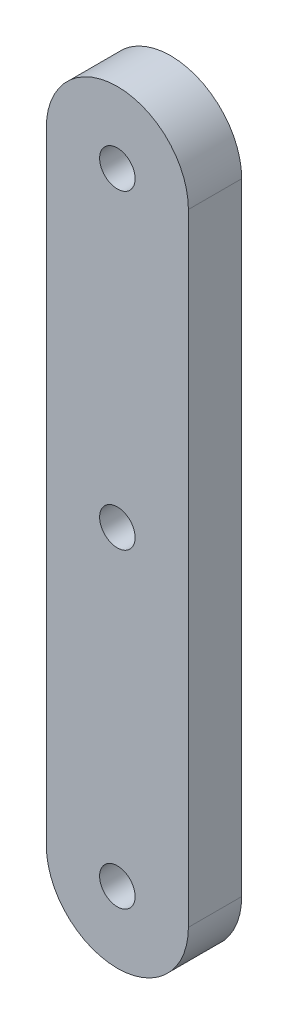
ISO-10303-21;
HEADER;
FILE_DESCRIPTION(('STEP AP214'),'2;1');
FILE_NAME('part.step','',(''),(''),'','','');
FILE_SCHEMA(('AUTOMOTIVE_DESIGN { 1 0 10303 214 1 1 1 1 }'));
ENDSEC;
DATA;
#1=APPLICATION_CONTEXT('core data for automotive mechanical design processes');
#2=APPLICATION_PROTOCOL_DEFINITION('international standard','automotive_design',2000,#1);
#3=PRODUCT_CONTEXT('',#1,'mechanical');
#4=PRODUCT('Part','Part','',(#3));
#5=PRODUCT_RELATED_PRODUCT_CATEGORY('part','',(#4));
#6=PRODUCT_DEFINITION_FORMATION('','',#4);
#7=PRODUCT_DEFINITION_CONTEXT('part definition',#1,'design');
#8=PRODUCT_DEFINITION('design','',#6,#7);
#9=PRODUCT_DEFINITION_SHAPE('','',#8);
#10=(LENGTH_UNIT() NAMED_UNIT(*) SI_UNIT(.MILLI.,.METRE.));
#11=(NAMED_UNIT(*) PLANE_ANGLE_UNIT() SI_UNIT($,.RADIAN.));
#12=(NAMED_UNIT(*) SI_UNIT($,.STERADIAN.) SOLID_ANGLE_UNIT());
#13=UNCERTAINTY_MEASURE_WITH_UNIT(LENGTH_MEASURE(1.E-05),#10,'distance_accuracy_value','');
#14=(GEOMETRIC_REPRESENTATION_CONTEXT(3) GLOBAL_UNCERTAINTY_ASSIGNED_CONTEXT((#13)) GLOBAL_UNIT_ASSIGNED_CONTEXT((#10,
#11,#12)) REPRESENTATION_CONTEXT('',''));
#15=CARTESIAN_POINT('',(0.,0.,0.));
#16=DIRECTION('',(0.,0.,1.));
#17=DIRECTION('',(1.,0.,0.));
#18=AXIS2_PLACEMENT_3D('',#15,#16,#17);
#19=CARTESIAN_POINT('',(35.7936644265069,45.6899336349123,3.));
#20=DIRECTION('',(0.,0.,1.));
#21=DIRECTION('',(1.,0.,0.));
#22=AXIS2_PLACEMENT_3D('',#19,#20,#21);
#23=PLANE('',#22);
#24=CARTESIAN_POINT('',(35.7936644265069,10.6899336349123,3.));
#25=DIRECTION('',(0.,0.,1.));
#26=DIRECTION('',(1.,0.,0.));
#27=AXIS2_PLACEMENT_3D('',#24,#25,#26);
#28=CIRCLE('',#27,1.);
#29=CARTESIAN_POINT('',(36.7936644265069,10.6899336349123,3.));
#30=VERTEX_POINT('',#29);
#31=EDGE_CURVE('E179',#30,#30,#28,.T.);
#32=ORIENTED_EDGE('',*,*,#31,.F.);
#33=EDGE_LOOP('',(#32));
#34=FACE_BOUND('',#33,.T.);
#35=CARTESIAN_POINT('',(35.7936644265069,45.6899336349123,3.));
#36=DIRECTION('',(0.,0.,1.));
#37=DIRECTION('',(1.,0.,0.));
#38=AXIS2_PLACEMENT_3D('',#35,#36,#37);
#39=CIRCLE('',#38,4.);
#40=CARTESIAN_POINT('',(39.7936644265069,45.6899336349123,3.));
#41=VERTEX_POINT('',#40);
#42=CARTESIAN_POINT('',(31.7936644265069,45.6899336349123,3.));
#43=VERTEX_POINT('',#42);
#44=EDGE_CURVE('E137',#41,#43,#39,.T.);
#45=ORIENTED_EDGE('',*,*,#44,.T.);
#46=DIRECTION('',(0.,-1.,0.));
#47=VECTOR('',#46,1.);
#48=CARTESIAN_POINT('',(31.7936644265069,45.6899336349123,3.));
#49=LINE('',#48,#47);
#50=CARTESIAN_POINT('',(31.7936644265069,10.6899336349123,3.));
#51=VERTEX_POINT('',#50);
#52=EDGE_CURVE('E132',#43,#51,#49,.T.);
#53=ORIENTED_EDGE('',*,*,#52,.T.);
#54=CARTESIAN_POINT('',(35.7936644265069,10.6899336349123,3.));
#55=DIRECTION('',(0.,0.,1.));
#56=DIRECTION('',(1.,0.,0.));
#57=AXIS2_PLACEMENT_3D('',#54,#55,#56);
#58=CIRCLE('',#57,4.);
#59=CARTESIAN_POINT('',(39.7936644265069,10.6899336349123,3.));
#60=VERTEX_POINT('',#59);
#61=EDGE_CURVE('E135',#51,#60,#58,.T.);
#62=ORIENTED_EDGE('',*,*,#61,.T.);
#63=DIRECTION('',(0.,1.,0.));
#64=VECTOR('',#63,1.);
#65=CARTESIAN_POINT('',(39.7936644265069,10.6899336349123,3.));
#66=LINE('',#65,#64);
#67=EDGE_CURVE('E102',#60,#41,#66,.T.);
#68=ORIENTED_EDGE('',*,*,#67,.T.);
#69=EDGE_LOOP('',(#45,#53,#62,#68));
#70=FACE_BOUND('',#69,.T.);
#71=CARTESIAN_POINT('',(35.7936644265069,45.6899336349123,3.));
#72=DIRECTION('',(0.,0.,1.));
#73=DIRECTION('',(1.,0.,0.));
#74=AXIS2_PLACEMENT_3D('',#71,#72,#73);
#75=CIRCLE('',#74,1.);
#76=CARTESIAN_POINT('',(36.7936644265069,45.6899336349123,3.));
#77=VERTEX_POINT('',#76);
#78=EDGE_CURVE('E157',#77,#77,#75,.T.);
#79=ORIENTED_EDGE('',*,*,#78,.F.);
#80=EDGE_LOOP('',(#79));
#81=FACE_BOUND('',#80,.T.);
#82=CARTESIAN_POINT('',(35.7936644265069,28.1899336349123,3.));
#83=DIRECTION('',(0.,0.,1.));
#84=DIRECTION('',(1.,0.,0.));
#85=AXIS2_PLACEMENT_3D('',#82,#83,#84);
#86=CIRCLE('',#85,1.);
#87=CARTESIAN_POINT('',(36.7936644265069,28.1899336349123,3.));
#88=VERTEX_POINT('',#87);
#89=EDGE_CURVE('E187',#88,#88,#86,.T.);
#90=ORIENTED_EDGE('',*,*,#89,.F.);
#91=EDGE_LOOP('',(#90));
#92=FACE_BOUND('',#91,.T.);
#93=ADVANCED_FACE('F84',(#34,#70,#81,#92),#23,.T.);
#94=CARTESIAN_POINT('',(35.7936644265069,45.6899336349123,0.));
#95=DIRECTION('',(0.,0.,1.));
#96=DIRECTION('',(1.,0.,0.));
#97=AXIS2_PLACEMENT_3D('',#94,#95,#96);
#98=PLANE('',#97);
#99=CARTESIAN_POINT('',(35.7936644265069,45.6899336349123,0.));
#100=DIRECTION('',(0.,0.,1.));
#101=DIRECTION('',(1.,0.,0.));
#102=AXIS2_PLACEMENT_3D('',#99,#100,#101);
#103=CIRCLE('',#102,4.);
#104=CARTESIAN_POINT('',(39.7936644265069,45.6899336349123,0.));
#105=VERTEX_POINT('',#104);
#106=CARTESIAN_POINT('',(31.7936644265069,45.6899336349123,0.));
#107=VERTEX_POINT('',#106);
#108=EDGE_CURVE('E153',#105,#107,#103,.T.);
#109=ORIENTED_EDGE('',*,*,#108,.F.);
#110=DIRECTION('',(0.,1.,0.));
#111=VECTOR('',#110,1.);
#112=CARTESIAN_POINT('',(39.7936644265069,10.6899336349123,0.));
#113=LINE('',#112,#111);
#114=CARTESIAN_POINT('',(39.7936644265069,10.6899336349123,0.));
#115=VERTEX_POINT('',#114);
#116=EDGE_CURVE('E125',#115,#105,#113,.T.);
#117=ORIENTED_EDGE('',*,*,#116,.F.);
#118=CARTESIAN_POINT('',(35.7936644265069,10.6899336349123,0.));
#119=DIRECTION('',(0.,0.,1.));
#120=DIRECTION('',(1.,0.,0.));
#121=AXIS2_PLACEMENT_3D('',#118,#119,#120);
#122=CIRCLE('',#121,4.);
#123=CARTESIAN_POINT('',(31.7936644265069,10.6899336349123,0.));
#124=VERTEX_POINT('',#123);
#125=EDGE_CURVE('E119',#124,#115,#122,.T.);
#126=ORIENTED_EDGE('',*,*,#125,.F.);
#127=DIRECTION('',(0.,-1.,0.));
#128=VECTOR('',#127,1.);
#129=CARTESIAN_POINT('',(31.7936644265069,45.6899336349123,0.));
#130=LINE('',#129,#128);
#131=EDGE_CURVE('E142',#107,#124,#130,.T.);
#132=ORIENTED_EDGE('',*,*,#131,.F.);
#133=EDGE_LOOP('',(#109,#117,#126,#132));
#134=FACE_BOUND('',#133,.T.);
#135=CARTESIAN_POINT('',(35.7936644265069,45.6899336349123,0.));
#136=DIRECTION('',(0.,0.,1.));
#137=DIRECTION('',(1.,0.,0.));
#138=AXIS2_PLACEMENT_3D('',#135,#136,#137);
#139=CIRCLE('',#138,1.);
#140=CARTESIAN_POINT('',(36.7936644265069,45.6899336349123,0.));
#141=VERTEX_POINT('',#140);
#142=EDGE_CURVE('E175',#141,#141,#139,.T.);
#143=ORIENTED_EDGE('',*,*,#142,.T.);
#144=EDGE_LOOP('',(#143));
#145=FACE_BOUND('',#144,.T.);
#146=CARTESIAN_POINT('',(35.7936644265069,10.6899336349123,0.));
#147=DIRECTION('',(0.,0.,1.));
#148=DIRECTION('',(1.,0.,0.));
#149=AXIS2_PLACEMENT_3D('',#146,#147,#148);
#150=CIRCLE('',#149,1.);
#151=CARTESIAN_POINT('',(36.7936644265069,10.6899336349123,0.));
#152=VERTEX_POINT('',#151);
#153=EDGE_CURVE('E183',#152,#152,#150,.T.);
#154=ORIENTED_EDGE('',*,*,#153,.T.);
#155=EDGE_LOOP('',(#154));
#156=FACE_BOUND('',#155,.T.);
#157=CARTESIAN_POINT('',(35.7936644265069,28.1899336349123,0.));
#158=DIRECTION('',(0.,0.,1.));
#159=DIRECTION('',(1.,0.,0.));
#160=AXIS2_PLACEMENT_3D('',#157,#158,#159);
#161=CIRCLE('',#160,1.);
#162=CARTESIAN_POINT('',(36.7936644265069,28.1899336349123,0.));
#163=VERTEX_POINT('',#162);
#164=EDGE_CURVE('E191',#163,#163,#161,.T.);
#165=ORIENTED_EDGE('',*,*,#164,.T.);
#166=EDGE_LOOP('',(#165));
#167=FACE_BOUND('',#166,.T.);
#168=ADVANCED_FACE('F170',(#134,#145,#156,#167),#98,.F.);
#169=CARTESIAN_POINT('',(35.7936644265069,45.6899336349123,3.));
#170=DIRECTION('',(0.,0.,-1.));
#171=DIRECTION('',(-1.,0.,0.));
#172=AXIS2_PLACEMENT_3D('',#169,#170,#171);
#173=CYLINDRICAL_SURFACE('',#172,4.);
#174=ORIENTED_EDGE('',*,*,#108,.T.);
#175=DIRECTION('',(0.,0.,-1.));
#176=VECTOR('',#175,1.);
#177=CARTESIAN_POINT('',(31.7936644265069,45.6899336349123,3.));
#178=LINE('',#177,#176);
#179=EDGE_CURVE('E12',#43,#107,#178,.T.);
#180=ORIENTED_EDGE('',*,*,#179,.F.);
#181=ORIENTED_EDGE('',*,*,#44,.F.);
#182=DIRECTION('',(0.,0.,-1.));
#183=VECTOR('',#182,1.);
#184=CARTESIAN_POINT('',(39.7936644265069,45.6899336349123,3.));
#185=LINE('',#184,#183);
#186=EDGE_CURVE('E149',#41,#105,#185,.T.);
#187=ORIENTED_EDGE('',*,*,#186,.T.);
#188=EDGE_LOOP('',(#174,#180,#181,#187));
#189=FACE_BOUND('',#188,.T.);
#190=ADVANCED_FACE('F86',(#189),#173,.T.);
#191=CARTESIAN_POINT('',(31.7936644265069,45.6899336349123,3.));
#192=DIRECTION('',(1.,0.,0.));
#193=DIRECTION('',(0.,0.,-1.));
#194=AXIS2_PLACEMENT_3D('',#191,#192,#193);
#195=PLANE('',#194);
#196=ORIENTED_EDGE('',*,*,#131,.T.);
#197=DIRECTION('',(0.,0.,-1.));
#198=VECTOR('',#197,1.);
#199=CARTESIAN_POINT('',(31.7936644265069,10.6899336349123,3.));
#200=LINE('',#199,#198);
#201=EDGE_CURVE('E94',#51,#124,#200,.T.);
#202=ORIENTED_EDGE('',*,*,#201,.F.);
#203=ORIENTED_EDGE('',*,*,#52,.F.);
#204=ORIENTED_EDGE('',*,*,#179,.T.);
#205=EDGE_LOOP('',(#196,#202,#203,#204));
#206=FACE_BOUND('',#205,.T.);
#207=ADVANCED_FACE('F141',(#206),#195,.F.);
#208=CARTESIAN_POINT('',(35.7936644265069,10.6899336349123,3.));
#209=DIRECTION('',(0.,0.,-1.));
#210=DIRECTION('',(-1.,0.,0.));
#211=AXIS2_PLACEMENT_3D('',#208,#209,#210);
#212=CYLINDRICAL_SURFACE('',#211,4.);
#213=ORIENTED_EDGE('',*,*,#125,.T.);
#214=DIRECTION('',(0.,0.,-1.));
#215=VECTOR('',#214,1.);
#216=CARTESIAN_POINT('',(39.7936644265069,10.6899336349123,3.));
#217=LINE('',#216,#215);
#218=EDGE_CURVE('E144',#60,#115,#217,.T.);
#219=ORIENTED_EDGE('',*,*,#218,.F.);
#220=ORIENTED_EDGE('',*,*,#61,.F.);
#221=ORIENTED_EDGE('',*,*,#201,.T.);
#222=EDGE_LOOP('',(#213,#219,#220,#221));
#223=FACE_BOUND('',#222,.T.);
#224=ADVANCED_FACE('F145',(#223),#212,.T.);
#225=CARTESIAN_POINT('',(39.7936644265069,10.6899336349123,3.));
#226=DIRECTION('',(-1.,0.,0.));
#227=DIRECTION('',(0.,0.,1.));
#228=AXIS2_PLACEMENT_3D('',#225,#226,#227);
#229=PLANE('',#228);
#230=ORIENTED_EDGE('',*,*,#116,.T.);
#231=ORIENTED_EDGE('',*,*,#186,.F.);
#232=ORIENTED_EDGE('',*,*,#67,.F.);
#233=ORIENTED_EDGE('',*,*,#218,.T.);
#234=EDGE_LOOP('',(#230,#231,#232,#233));
#235=FACE_BOUND('',#234,.T.);
#236=ADVANCED_FACE('F167',(#235),#229,.F.);
#237=CARTESIAN_POINT('',(35.7936644265069,45.6899336349123,3.));
#238=DIRECTION('',(0.,0.,-1.));
#239=DIRECTION('',(-1.,0.,0.));
#240=AXIS2_PLACEMENT_3D('',#237,#238,#239);
#241=CYLINDRICAL_SURFACE('',#240,1.);
#242=ORIENTED_EDGE('',*,*,#78,.T.);
#243=EDGE_LOOP('',(#242));
#244=FACE_BOUND('',#243,.T.);
#245=ORIENTED_EDGE('',*,*,#142,.F.);
#246=EDGE_LOOP('',(#245));
#247=FACE_BOUND('',#246,.T.);
#248=ADVANCED_FACE('F211',(#244,#247),#241,.F.);
#249=CARTESIAN_POINT('',(35.7936644265069,10.6899336349123,3.));
#250=DIRECTION('',(0.,0.,-1.));
#251=DIRECTION('',(-1.,0.,0.));
#252=AXIS2_PLACEMENT_3D('',#249,#250,#251);
#253=CYLINDRICAL_SURFACE('',#252,1.);
#254=ORIENTED_EDGE('',*,*,#31,.T.);
#255=EDGE_LOOP('',(#254));
#256=FACE_BOUND('',#255,.T.);
#257=ORIENTED_EDGE('',*,*,#153,.F.);
#258=EDGE_LOOP('',(#257));
#259=FACE_BOUND('',#258,.T.);
#260=ADVANCED_FACE('F257',(#256,#259),#253,.F.);
#261=CARTESIAN_POINT('',(35.7936644265069,28.1899336349123,3.));
#262=DIRECTION('',(0.,0.,-1.));
#263=DIRECTION('',(-1.,0.,0.));
#264=AXIS2_PLACEMENT_3D('',#261,#262,#263);
#265=CYLINDRICAL_SURFACE('',#264,1.);
#266=ORIENTED_EDGE('',*,*,#89,.T.);
#267=EDGE_LOOP('',(#266));
#268=FACE_BOUND('',#267,.T.);
#269=ORIENTED_EDGE('',*,*,#164,.F.);
#270=EDGE_LOOP('',(#269));
#271=FACE_BOUND('',#270,.T.);
#272=ADVANCED_FACE('F199',(#268,#271),#265,.F.);
#273=CLOSED_SHELL('',(#93,#168,#190,#207,#224,#236,#248,#260,#272));
#274=MANIFOLD_SOLID_BREP('B2',#273);
#275=ADVANCED_BREP_SHAPE_REPRESENTATION('',(#18,#274),#14);
#276=SHAPE_DEFINITION_REPRESENTATION(#9,#275);
ENDSEC;
END-ISO-10303-21;
